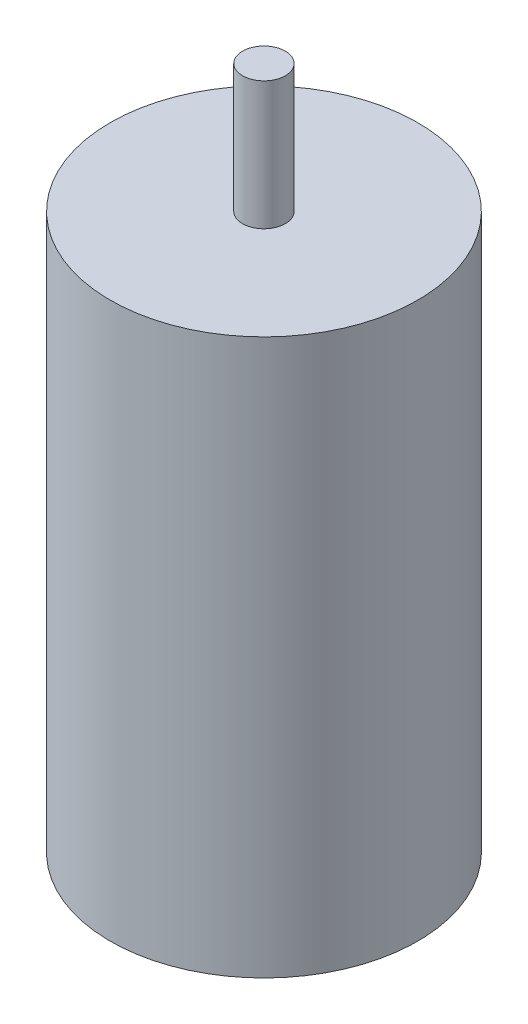
ISO-10303-21;
HEADER;
FILE_DESCRIPTION(('STEP AP214'),'2;1');
FILE_NAME('part.step','',(''),(''),'','','');
FILE_SCHEMA(('AUTOMOTIVE_DESIGN { 1 0 10303 214 1 1 1 1 }'));
ENDSEC;
DATA;
#1=APPLICATION_CONTEXT('core data for automotive mechanical design processes');
#2=APPLICATION_PROTOCOL_DEFINITION('international standard','automotive_design',2000,#1);
#3=PRODUCT_CONTEXT('',#1,'mechanical');
#4=PRODUCT('Part','Part','',(#3));
#5=PRODUCT_RELATED_PRODUCT_CATEGORY('part','',(#4));
#6=PRODUCT_DEFINITION_FORMATION('','',#4);
#7=PRODUCT_DEFINITION_CONTEXT('part definition',#1,'design');
#8=PRODUCT_DEFINITION('design','',#6,#7);
#9=PRODUCT_DEFINITION_SHAPE('','',#8);
#10=(LENGTH_UNIT() NAMED_UNIT(*) SI_UNIT(.MILLI.,.METRE.));
#11=(NAMED_UNIT(*) PLANE_ANGLE_UNIT() SI_UNIT($,.RADIAN.));
#12=(NAMED_UNIT(*) SI_UNIT($,.STERADIAN.) SOLID_ANGLE_UNIT());
#13=UNCERTAINTY_MEASURE_WITH_UNIT(LENGTH_MEASURE(1.E-05),#10,'distance_accuracy_value','');
#14=(GEOMETRIC_REPRESENTATION_CONTEXT(3) GLOBAL_UNCERTAINTY_ASSIGNED_CONTEXT((#13)) GLOBAL_UNIT_ASSIGNED_CONTEXT((#10,
#11,#12)) REPRESENTATION_CONTEXT('',''));
#15=CARTESIAN_POINT('',(0.,0.,0.));
#16=DIRECTION('',(0.,0.,1.));
#17=DIRECTION('',(1.,0.,0.));
#18=AXIS2_PLACEMENT_3D('',#15,#16,#17);
#19=CARTESIAN_POINT('',(0.,32.5,0.));
#20=DIRECTION('',(0.,1.,0.));
#21=DIRECTION('',(1.,0.,0.));
#22=AXIS2_PLACEMENT_3D('',#19,#20,#21);
#23=PLANE('',#22);
#24=CARTESIAN_POINT('',(0.,32.5,0.));
#25=DIRECTION('',(0.,-1.,0.));
#26=DIRECTION('',(-1.,0.,0.));
#27=AXIS2_PLACEMENT_3D('',#24,#25,#26);
#28=CIRCLE('',#27,2.5);
#29=CARTESIAN_POINT('',(2.5,32.5,0.));
#30=VERTEX_POINT('',#29);
#31=EDGE_CURVE('E56',#30,#30,#28,.T.);
#32=ORIENTED_EDGE('',*,*,#31,.T.);
#33=EDGE_LOOP('',(#32));
#34=FACE_BOUND('',#33,.T.);
#35=CARTESIAN_POINT('',(0.,32.5,0.));
#36=DIRECTION('',(0.,1.,0.));
#37=DIRECTION('',(1.,0.,0.));
#38=AXIS2_PLACEMENT_3D('',#35,#36,#37);
#39=CIRCLE('',#38,18.);
#40=CARTESIAN_POINT('',(-18.,32.5,0.));
#41=VERTEX_POINT('',#40);
#42=EDGE_CURVE('E27',#41,#41,#39,.T.);
#43=ORIENTED_EDGE('',*,*,#42,.T.);
#44=EDGE_LOOP('',(#43));
#45=FACE_BOUND('',#44,.T.);
#46=ADVANCED_FACE('F16',(#34,#45),#23,.T.);
#47=CARTESIAN_POINT('',(0.,0.,0.));
#48=DIRECTION('',(0.,1.,0.));
#49=DIRECTION('',(1.,0.,0.));
#50=AXIS2_PLACEMENT_3D('',#47,#48,#49);
#51=CYLINDRICAL_SURFACE('',#50,18.);
#52=ORIENTED_EDGE('',*,*,#42,.F.);
#53=DIRECTION('',(0.,-1.,0.));
#54=VECTOR('',#53,1.);
#55=CARTESIAN_POINT('',(-18.,0.,0.));
#56=LINE('',#55,#54);
#57=CARTESIAN_POINT('',(-18.,-32.5,0.));
#58=VERTEX_POINT('',#57);
#59=EDGE_CURVE('E10',#41,#58,#56,.T.);
#60=ORIENTED_EDGE('',*,*,#59,.T.);
#61=CARTESIAN_POINT('',(0.,-32.5,0.));
#62=DIRECTION('',(0.,-1.,0.));
#63=DIRECTION('',(1.,0.,0.));
#64=AXIS2_PLACEMENT_3D('',#61,#62,#63);
#65=CIRCLE('',#64,18.);
#66=EDGE_CURVE('E59',#58,#58,#65,.T.);
#67=ORIENTED_EDGE('',*,*,#66,.F.);
#68=ORIENTED_EDGE('',*,*,#59,.F.);
#69=EDGE_LOOP('',(#52,#60,#67,#68));
#70=FACE_BOUND('',#69,.T.);
#71=ADVANCED_FACE('F73',(#70),#51,.T.);
#72=CARTESIAN_POINT('',(0.,-32.5,0.));
#73=DIRECTION('',(0.,1.,0.));
#74=DIRECTION('',(1.,0.,0.));
#75=AXIS2_PLACEMENT_3D('',#72,#73,#74);
#76=PLANE('',#75);
#77=ORIENTED_EDGE('',*,*,#66,.T.);
#78=EDGE_LOOP('',(#77));
#79=FACE_BOUND('',#78,.T.);
#80=ADVANCED_FACE('F75',(#79),#76,.F.);
#81=CARTESIAN_POINT('',(0.,47.5,0.));
#82=DIRECTION('',(0.,1.,0.));
#83=DIRECTION('',(1.,0.,0.));
#84=AXIS2_PLACEMENT_3D('',#81,#82,#83);
#85=PLANE('',#84);
#86=CARTESIAN_POINT('',(0.,47.5,0.));
#87=DIRECTION('',(0.,1.,0.));
#88=DIRECTION('',(-1.,0.,0.));
#89=AXIS2_PLACEMENT_3D('',#86,#87,#88);
#90=CIRCLE('',#89,2.5);
#91=CARTESIAN_POINT('',(2.5,47.5,0.));
#92=VERTEX_POINT('',#91);
#93=EDGE_CURVE('E20',#92,#92,#90,.T.);
#94=ORIENTED_EDGE('',*,*,#93,.T.);
#95=EDGE_LOOP('',(#94));
#96=FACE_BOUND('',#95,.T.);
#97=ADVANCED_FACE('F77',(#96),#85,.T.);
#98=CARTESIAN_POINT('',(0.,32.5,0.));
#99=DIRECTION('',(0.,1.,0.));
#100=DIRECTION('',(-1.,0.,0.));
#101=AXIS2_PLACEMENT_3D('',#98,#99,#100);
#102=CYLINDRICAL_SURFACE('',#101,2.5);
#103=ORIENTED_EDGE('',*,*,#93,.F.);
#104=DIRECTION('',(0.,-1.,0.));
#105=VECTOR('',#104,1.);
#106=CARTESIAN_POINT('',(2.5,32.5,0.));
#107=LINE('',#106,#105);
#108=EDGE_CURVE('E50',#92,#30,#107,.T.);
#109=ORIENTED_EDGE('',*,*,#108,.T.);
#110=ORIENTED_EDGE('',*,*,#31,.F.);
#111=ORIENTED_EDGE('',*,*,#108,.F.);
#112=EDGE_LOOP('',(#103,#109,#110,#111));
#113=FACE_BOUND('',#112,.T.);
#114=ADVANCED_FACE('F18',(#113),#102,.T.);
#115=CLOSED_SHELL('',(#46,#71,#80,#97,#114));
#116=MANIFOLD_SOLID_BREP('B1',#115);
#117=ADVANCED_BREP_SHAPE_REPRESENTATION('',(#18,#116),#14);
#118=SHAPE_DEFINITION_REPRESENTATION(#9,#117);
ENDSEC;
END-ISO-10303-21;
